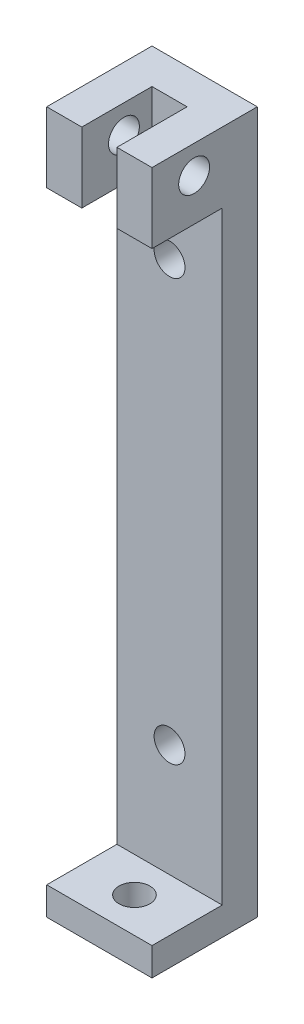
ISO-10303-21;
HEADER;
FILE_DESCRIPTION(('STEP AP214'),'2;1');
FILE_NAME('part.step','',(''),(''),'','','');
FILE_SCHEMA(('AUTOMOTIVE_DESIGN { 1 0 10303 214 1 1 1 1 }'));
ENDSEC;
DATA;
#1=APPLICATION_CONTEXT('core data for automotive mechanical design processes');
#2=APPLICATION_PROTOCOL_DEFINITION('international standard','automotive_design',2000,#1);
#3=PRODUCT_CONTEXT('',#1,'mechanical');
#4=PRODUCT('Part','Part','',(#3));
#5=PRODUCT_RELATED_PRODUCT_CATEGORY('part','',(#4));
#6=PRODUCT_DEFINITION_FORMATION('','',#4);
#7=PRODUCT_DEFINITION_CONTEXT('part definition',#1,'design');
#8=PRODUCT_DEFINITION('design','',#6,#7);
#9=PRODUCT_DEFINITION_SHAPE('','',#8);
#10=(LENGTH_UNIT() NAMED_UNIT(*) SI_UNIT(.MILLI.,.METRE.));
#11=(NAMED_UNIT(*) PLANE_ANGLE_UNIT() SI_UNIT($,.RADIAN.));
#12=(NAMED_UNIT(*) SI_UNIT($,.STERADIAN.) SOLID_ANGLE_UNIT());
#13=UNCERTAINTY_MEASURE_WITH_UNIT(LENGTH_MEASURE(1.E-05),#10,'distance_accuracy_value','');
#14=(GEOMETRIC_REPRESENTATION_CONTEXT(3) GLOBAL_UNCERTAINTY_ASSIGNED_CONTEXT((#13)) GLOBAL_UNIT_ASSIGNED_CONTEXT((#10,
#11,#12)) REPRESENTATION_CONTEXT('',''));
#15=CARTESIAN_POINT('',(0.,0.,0.));
#16=DIRECTION('',(0.,0.,1.));
#17=DIRECTION('',(1.,0.,0.));
#18=AXIS2_PLACEMENT_3D('',#15,#16,#17);
#19=CARTESIAN_POINT('',(-7.5,100.,-2.5));
#20=DIRECTION('',(0.,0.,-1.));
#21=DIRECTION('',(-1.,0.,0.));
#22=AXIS2_PLACEMENT_3D('',#19,#20,#21);
#23=PLANE('',#22);
#24=CARTESIAN_POINT('',(0.,20.,-2.5));
#25=DIRECTION('',(0.,0.,1.));
#26=DIRECTION('',(1.,0.,0.));
#27=AXIS2_PLACEMENT_3D('',#24,#25,#26);
#28=CIRCLE('',#27,2.2);
#29=CARTESIAN_POINT('',(2.2,20.,-2.5));
#30=VERTEX_POINT('',#29);
#31=EDGE_CURVE('E355',#30,#30,#28,.T.);
#32=ORIENTED_EDGE('',*,*,#31,.F.);
#33=EDGE_LOOP('',(#32));
#34=FACE_BOUND('',#33,.T.);
#35=CARTESIAN_POINT('',(0.,80.,-2.5));
#36=DIRECTION('',(0.,0.,1.));
#37=DIRECTION('',(1.,0.,0.));
#38=AXIS2_PLACEMENT_3D('',#35,#36,#37);
#39=CIRCLE('',#38,2.2);
#40=CARTESIAN_POINT('',(2.2,80.,-2.5));
#41=VERTEX_POINT('',#40);
#42=EDGE_CURVE('E358',#41,#41,#39,.T.);
#43=ORIENTED_EDGE('',*,*,#42,.F.);
#44=EDGE_LOOP('',(#43));
#45=FACE_BOUND('',#44,.T.);
#46=DIRECTION('',(0.,-1.,0.));
#47=VECTOR('',#46,1.);
#48=CARTESIAN_POINT('',(2.5,100.,-2.5));
#49=LINE('',#48,#47);
#50=CARTESIAN_POINT('',(2.5,100.,-2.5));
#51=VERTEX_POINT('',#50);
#52=CARTESIAN_POINT('',(2.5,90.,-2.5));
#53=VERTEX_POINT('',#52);
#54=EDGE_CURVE('E153',#51,#53,#49,.T.);
#55=ORIENTED_EDGE('',*,*,#54,.F.);
#56=DIRECTION('',(1.,0.,0.));
#57=VECTOR('',#56,1.);
#58=CARTESIAN_POINT('',(-7.5,100.,-2.5));
#59=LINE('',#58,#57);
#60=CARTESIAN_POINT('',(-2.5,100.,-2.5));
#61=VERTEX_POINT('',#60);
#62=EDGE_CURVE('E137',#61,#51,#59,.T.);
#63=ORIENTED_EDGE('',*,*,#62,.F.);
#64=DIRECTION('',(0.,1.,0.));
#65=VECTOR('',#64,1.);
#66=CARTESIAN_POINT('',(-2.5,100.,-2.5));
#67=LINE('',#66,#65);
#68=CARTESIAN_POINT('',(-2.5,90.,-2.5));
#69=VERTEX_POINT('',#68);
#70=EDGE_CURVE('E174',#69,#61,#67,.T.);
#71=ORIENTED_EDGE('',*,*,#70,.F.);
#72=DIRECTION('',(1.,0.,0.));
#73=VECTOR('',#72,1.);
#74=CARTESIAN_POINT('',(-7.5,90.,-2.5));
#75=LINE('',#74,#73);
#76=CARTESIAN_POINT('',(-7.5,90.,-2.5));
#77=VERTEX_POINT('',#76);
#78=EDGE_CURVE('E169',#77,#69,#75,.T.);
#79=ORIENTED_EDGE('',*,*,#78,.F.);
#80=DIRECTION('',(0.,-1.,0.));
#81=VECTOR('',#80,1.);
#82=CARTESIAN_POINT('',(-7.5,100.,-2.5));
#83=LINE('',#82,#81);
#84=CARTESIAN_POINT('',(-7.5,4.,-2.5));
#85=VERTEX_POINT('',#84);
#86=EDGE_CURVE('E58',#77,#85,#83,.T.);
#87=ORIENTED_EDGE('',*,*,#86,.T.);
#88=DIRECTION('',(1.,0.,0.));
#89=VECTOR('',#88,1.);
#90=CARTESIAN_POINT('',(-7.5,4.,-2.5));
#91=LINE('',#90,#89);
#92=CARTESIAN_POINT('',(7.5,4.,-2.5));
#93=VERTEX_POINT('',#92);
#94=EDGE_CURVE('E189',#85,#93,#91,.T.);
#95=ORIENTED_EDGE('',*,*,#94,.T.);
#96=DIRECTION('',(0.,-1.,0.));
#97=VECTOR('',#96,1.);
#98=CARTESIAN_POINT('',(7.5,100.,-2.5));
#99=LINE('',#98,#97);
#100=CARTESIAN_POINT('',(7.5,90.,-2.5));
#101=VERTEX_POINT('',#100);
#102=EDGE_CURVE('E196',#101,#93,#99,.T.);
#103=ORIENTED_EDGE('',*,*,#102,.F.);
#104=DIRECTION('',(1.,0.,0.));
#105=VECTOR('',#104,1.);
#106=CARTESIAN_POINT('',(7.5,90.,-2.5));
#107=LINE('',#106,#105);
#108=EDGE_CURVE('E151',#53,#101,#107,.T.);
#109=ORIENTED_EDGE('',*,*,#108,.F.);
#110=EDGE_LOOP('',(#55,#63,#71,#79,#87,#95,#103,#109));
#111=FACE_BOUND('',#110,.T.);
#112=ADVANCED_FACE('F35',(#34,#45,#111),#23,.F.);
#113=CARTESIAN_POINT('',(0.,4.,0.));
#114=DIRECTION('',(0.,-1.,0.));
#115=DIRECTION('',(0.,0.,-1.));
#116=AXIS2_PLACEMENT_3D('',#113,#114,#115);
#117=PLANE('',#116);
#118=CARTESIAN_POINT('',(0.,4.,2.5));
#119=DIRECTION('',(0.,1.,0.));
#120=DIRECTION('',(0.,0.,1.));
#121=AXIS2_PLACEMENT_3D('',#118,#119,#120);
#122=CIRCLE('',#121,2.2);
#123=CARTESIAN_POINT('',(0.,4.,4.7));
#124=VERTEX_POINT('',#123);
#125=EDGE_CURVE('E156',#124,#124,#122,.T.);
#126=ORIENTED_EDGE('',*,*,#125,.F.);
#127=EDGE_LOOP('',(#126));
#128=FACE_BOUND('',#127,.T.);
#129=ORIENTED_EDGE('',*,*,#94,.F.);
#130=DIRECTION('',(0.,0.,1.));
#131=VECTOR('',#130,1.);
#132=CARTESIAN_POINT('',(-7.5,4.,7.5));
#133=LINE('',#132,#131);
#134=CARTESIAN_POINT('',(-7.5,4.,7.5));
#135=VERTEX_POINT('',#134);
#136=EDGE_CURVE('E202',#85,#135,#133,.T.);
#137=ORIENTED_EDGE('',*,*,#136,.T.);
#138=DIRECTION('',(1.,0.,0.));
#139=VECTOR('',#138,1.);
#140=CARTESIAN_POINT('',(-7.5,4.,7.5));
#141=LINE('',#140,#139);
#142=CARTESIAN_POINT('',(7.5,4.,7.5));
#143=VERTEX_POINT('',#142);
#144=EDGE_CURVE('E205',#135,#143,#141,.T.);
#145=ORIENTED_EDGE('',*,*,#144,.T.);
#146=DIRECTION('',(0.,0.,-1.));
#147=VECTOR('',#146,1.);
#148=CARTESIAN_POINT('',(7.5,4.,7.5));
#149=LINE('',#148,#147);
#150=EDGE_CURVE('E199',#143,#93,#149,.T.);
#151=ORIENTED_EDGE('',*,*,#150,.T.);
#152=EDGE_LOOP('',(#129,#137,#145,#151));
#153=FACE_BOUND('',#152,.T.);
#154=ADVANCED_FACE('F237',(#128,#153),#117,.F.);
#155=CARTESIAN_POINT('',(7.5,4.,7.5));
#156=DIRECTION('',(-1.,0.,0.));
#157=DIRECTION('',(0.,0.,1.));
#158=AXIS2_PLACEMENT_3D('',#155,#156,#157);
#159=PLANE('',#158);
#160=CARTESIAN_POINT('',(7.5,96.,1.5));
#161=DIRECTION('',(1.,0.,0.));
#162=DIRECTION('',(0.,0.,-1.));
#163=AXIS2_PLACEMENT_3D('',#160,#161,#162);
#164=CIRCLE('',#163,2.19999999999999);
#165=CARTESIAN_POINT('',(7.5,96.,-0.699999999999994));
#166=VERTEX_POINT('',#165);
#167=EDGE_CURVE('E315',#166,#166,#164,.T.);
#168=ORIENTED_EDGE('',*,*,#167,.F.);
#169=EDGE_LOOP('',(#168));
#170=FACE_BOUND('',#169,.T.);
#171=DIRECTION('',(0.,0.,-1.));
#172=VECTOR('',#171,1.);
#173=CARTESIAN_POINT('',(7.5,0.,7.5));
#174=LINE('',#173,#172);
#175=CARTESIAN_POINT('',(7.5,0.,7.5));
#176=VERTEX_POINT('',#175);
#177=CARTESIAN_POINT('',(7.5,0.,-7.5));
#178=VERTEX_POINT('',#177);
#179=EDGE_CURVE('E198',#176,#178,#174,.T.);
#180=ORIENTED_EDGE('',*,*,#179,.T.);
#181=DIRECTION('',(0.,-1.,0.));
#182=VECTOR('',#181,1.);
#183=CARTESIAN_POINT('',(7.5,4.,-7.5));
#184=LINE('',#183,#182);
#185=CARTESIAN_POINT('',(7.5,100.,-7.5));
#186=VERTEX_POINT('',#185);
#187=EDGE_CURVE('E11',#186,#178,#184,.T.);
#188=ORIENTED_EDGE('',*,*,#187,.F.);
#189=DIRECTION('',(0.,0.,1.));
#190=VECTOR('',#189,1.);
#191=CARTESIAN_POINT('',(7.5,100.,-7.5));
#192=LINE('',#191,#190);
#193=CARTESIAN_POINT('',(7.5,100.,7.5));
#194=VERTEX_POINT('',#193);
#195=EDGE_CURVE('E128',#186,#194,#192,.T.);
#196=ORIENTED_EDGE('',*,*,#195,.T.);
#197=DIRECTION('',(0.,1.,0.));
#198=VECTOR('',#197,1.);
#199=CARTESIAN_POINT('',(7.5,100.,7.5));
#200=LINE('',#199,#198);
#201=CARTESIAN_POINT('',(7.5,90.,7.5));
#202=VERTEX_POINT('',#201);
#203=EDGE_CURVE('E133',#202,#194,#200,.T.);
#204=ORIENTED_EDGE('',*,*,#203,.F.);
#205=DIRECTION('',(0.,0.,-1.));
#206=VECTOR('',#205,1.);
#207=CARTESIAN_POINT('',(7.5,90.,7.5));
#208=LINE('',#207,#206);
#209=EDGE_CURVE('E161',#202,#101,#208,.T.);
#210=ORIENTED_EDGE('',*,*,#209,.T.);
#211=ORIENTED_EDGE('',*,*,#102,.T.);
#212=ORIENTED_EDGE('',*,*,#150,.F.);
#213=DIRECTION('',(0.,-1.,0.));
#214=VECTOR('',#213,1.);
#215=CARTESIAN_POINT('',(7.5,4.,7.5));
#216=LINE('',#215,#214);
#217=EDGE_CURVE('E207',#143,#176,#216,.T.);
#218=ORIENTED_EDGE('',*,*,#217,.T.);
#219=EDGE_LOOP('',(#180,#188,#196,#204,#210,#211,#212,#218));
#220=FACE_BOUND('',#219,.T.);
#221=ADVANCED_FACE('F37',(#170,#220),#159,.F.);
#222=CARTESIAN_POINT('',(-7.5,4.,-7.5));
#223=DIRECTION('',(0.,0.,1.));
#224=DIRECTION('',(1.,0.,0.));
#225=AXIS2_PLACEMENT_3D('',#222,#223,#224);
#226=PLANE('',#225);
#227=CARTESIAN_POINT('',(0.,20.,-7.5));
#228=DIRECTION('',(0.,0.,1.));
#229=DIRECTION('',(1.,0.,0.));
#230=AXIS2_PLACEMENT_3D('',#227,#228,#229);
#231=CIRCLE('',#230,2.2);
#232=CARTESIAN_POINT('',(2.2,20.,-7.5));
#233=VERTEX_POINT('',#232);
#234=EDGE_CURVE('E290',#233,#233,#231,.T.);
#235=ORIENTED_EDGE('',*,*,#234,.T.);
#236=EDGE_LOOP('',(#235));
#237=FACE_BOUND('',#236,.T.);
#238=CARTESIAN_POINT('',(0.,80.,-7.5));
#239=DIRECTION('',(0.,0.,1.));
#240=DIRECTION('',(1.,0.,0.));
#241=AXIS2_PLACEMENT_3D('',#238,#239,#240);
#242=CIRCLE('',#241,2.2);
#243=CARTESIAN_POINT('',(2.2,80.,-7.5));
#244=VERTEX_POINT('',#243);
#245=EDGE_CURVE('E293',#244,#244,#242,.T.);
#246=ORIENTED_EDGE('',*,*,#245,.T.);
#247=EDGE_LOOP('',(#246));
#248=FACE_BOUND('',#247,.T.);
#249=DIRECTION('',(-1.,0.,0.));
#250=VECTOR('',#249,1.);
#251=CARTESIAN_POINT('',(-7.5,0.,-7.5));
#252=LINE('',#251,#250);
#253=CARTESIAN_POINT('',(-7.5,0.,-7.5));
#254=VERTEX_POINT('',#253);
#255=EDGE_CURVE('E209',#178,#254,#252,.T.);
#256=ORIENTED_EDGE('',*,*,#255,.T.);
#257=DIRECTION('',(0.,-1.,0.));
#258=VECTOR('',#257,1.);
#259=CARTESIAN_POINT('',(-7.5,4.,-7.5));
#260=LINE('',#259,#258);
#261=CARTESIAN_POINT('',(-7.5,100.,-7.5));
#262=VERTEX_POINT('',#261);
#263=EDGE_CURVE('E43',#262,#254,#260,.T.);
#264=ORIENTED_EDGE('',*,*,#263,.F.);
#265=DIRECTION('',(1.,0.,0.));
#266=VECTOR('',#265,1.);
#267=CARTESIAN_POINT('',(-7.5,100.,-7.5));
#268=LINE('',#267,#266);
#269=EDGE_CURVE('E136',#262,#186,#268,.T.);
#270=ORIENTED_EDGE('',*,*,#269,.T.);
#271=ORIENTED_EDGE('',*,*,#187,.T.);
#272=EDGE_LOOP('',(#256,#264,#270,#271));
#273=FACE_BOUND('',#272,.T.);
#274=ADVANCED_FACE('F279',(#237,#248,#273),#226,.F.);
#275=CARTESIAN_POINT('',(-7.5,4.,7.5));
#276=DIRECTION('',(1.,0.,0.));
#277=DIRECTION('',(0.,0.,-1.));
#278=AXIS2_PLACEMENT_3D('',#275,#276,#277);
#279=PLANE('',#278);
#280=CARTESIAN_POINT('',(-7.5,96.,1.5));
#281=DIRECTION('',(-1.,0.,0.));
#282=DIRECTION('',(0.,0.,1.));
#283=AXIS2_PLACEMENT_3D('',#280,#281,#282);
#284=CIRCLE('',#283,2.19999999999999);
#285=CARTESIAN_POINT('',(-7.5,96.,3.69999999999999));
#286=VERTEX_POINT('',#285);
#287=EDGE_CURVE('E312',#286,#286,#284,.T.);
#288=ORIENTED_EDGE('',*,*,#287,.F.);
#289=EDGE_LOOP('',(#288));
#290=FACE_BOUND('',#289,.T.);
#291=DIRECTION('',(0.,0.,1.));
#292=VECTOR('',#291,1.);
#293=CARTESIAN_POINT('',(-7.5,0.,7.5));
#294=LINE('',#293,#292);
#295=CARTESIAN_POINT('',(-7.5,0.,7.5));
#296=VERTEX_POINT('',#295);
#297=EDGE_CURVE('E211',#254,#296,#294,.T.);
#298=ORIENTED_EDGE('',*,*,#297,.T.);
#299=DIRECTION('',(0.,-1.,0.));
#300=VECTOR('',#299,1.);
#301=CARTESIAN_POINT('',(-7.5,4.,7.5));
#302=LINE('',#301,#300);
#303=EDGE_CURVE('E216',#135,#296,#302,.T.);
#304=ORIENTED_EDGE('',*,*,#303,.F.);
#305=ORIENTED_EDGE('',*,*,#136,.F.);
#306=ORIENTED_EDGE('',*,*,#86,.F.);
#307=DIRECTION('',(0.,0.,-1.));
#308=VECTOR('',#307,1.);
#309=CARTESIAN_POINT('',(-7.5,90.,7.5));
#310=LINE('',#309,#308);
#311=CARTESIAN_POINT('',(-7.5,90.,7.5));
#312=VERTEX_POINT('',#311);
#313=EDGE_CURVE('E187',#312,#77,#310,.T.);
#314=ORIENTED_EDGE('',*,*,#313,.F.);
#315=DIRECTION('',(0.,-1.,0.));
#316=VECTOR('',#315,1.);
#317=CARTESIAN_POINT('',(-7.5,100.,7.5));
#318=LINE('',#317,#316);
#319=CARTESIAN_POINT('',(-7.5,100.,7.5));
#320=VERTEX_POINT('',#319);
#321=EDGE_CURVE('E170',#320,#312,#318,.T.);
#322=ORIENTED_EDGE('',*,*,#321,.F.);
#323=DIRECTION('',(0.,0.,1.));
#324=VECTOR('',#323,1.);
#325=CARTESIAN_POINT('',(-7.5,100.,-7.5));
#326=LINE('',#325,#324);
#327=EDGE_CURVE('E192',#262,#320,#326,.T.);
#328=ORIENTED_EDGE('',*,*,#327,.F.);
#329=ORIENTED_EDGE('',*,*,#263,.T.);
#330=EDGE_LOOP('',(#298,#304,#305,#306,#314,#322,#328,#329));
#331=FACE_BOUND('',#330,.T.);
#332=ADVANCED_FACE('F222',(#290,#331),#279,.F.);
#333=CARTESIAN_POINT('',(-7.5,4.,7.5));
#334=DIRECTION('',(0.,0.,-1.));
#335=DIRECTION('',(-1.,0.,0.));
#336=AXIS2_PLACEMENT_3D('',#333,#334,#335);
#337=PLANE('',#336);
#338=DIRECTION('',(1.,0.,0.));
#339=VECTOR('',#338,1.);
#340=CARTESIAN_POINT('',(-7.5,0.,7.5));
#341=LINE('',#340,#339);
#342=EDGE_CURVE('E203',#296,#176,#341,.T.);
#343=ORIENTED_EDGE('',*,*,#342,.T.);
#344=ORIENTED_EDGE('',*,*,#217,.F.);
#345=ORIENTED_EDGE('',*,*,#144,.F.);
#346=ORIENTED_EDGE('',*,*,#303,.T.);
#347=EDGE_LOOP('',(#343,#344,#345,#346));
#348=FACE_BOUND('',#347,.T.);
#349=ADVANCED_FACE('F232',(#348),#337,.F.);
#350=CARTESIAN_POINT('',(0.,0.,0.));
#351=DIRECTION('',(0.,-1.,0.));
#352=DIRECTION('',(0.,0.,-1.));
#353=AXIS2_PLACEMENT_3D('',#350,#351,#352);
#354=PLANE('',#353);
#355=CARTESIAN_POINT('',(0.,0.,2.5));
#356=DIRECTION('',(0.,1.,0.));
#357=DIRECTION('',(0.,0.,1.));
#358=AXIS2_PLACEMENT_3D('',#355,#356,#357);
#359=CIRCLE('',#358,2.2);
#360=CARTESIAN_POINT('',(0.,0.,4.7));
#361=VERTEX_POINT('',#360);
#362=EDGE_CURVE('E162',#361,#361,#359,.T.);
#363=ORIENTED_EDGE('',*,*,#362,.T.);
#364=EDGE_LOOP('',(#363));
#365=FACE_BOUND('',#364,.T.);
#366=ORIENTED_EDGE('',*,*,#179,.F.);
#367=ORIENTED_EDGE('',*,*,#342,.F.);
#368=ORIENTED_EDGE('',*,*,#297,.F.);
#369=ORIENTED_EDGE('',*,*,#255,.F.);
#370=EDGE_LOOP('',(#366,#367,#368,#369));
#371=FACE_BOUND('',#370,.T.);
#372=ADVANCED_FACE('F229',(#365,#371),#354,.T.);
#373=CARTESIAN_POINT('',(0.,100.,0.));
#374=DIRECTION('',(0.,-1.,0.));
#375=DIRECTION('',(0.,0.,-1.));
#376=AXIS2_PLACEMENT_3D('',#373,#374,#375);
#377=PLANE('',#376);
#378=ORIENTED_EDGE('',*,*,#327,.T.);
#379=DIRECTION('',(-1.,0.,0.));
#380=VECTOR('',#379,1.);
#381=CARTESIAN_POINT('',(-7.5,100.,7.5));
#382=LINE('',#381,#380);
#383=CARTESIAN_POINT('',(-2.5,100.,7.5));
#384=VERTEX_POINT('',#383);
#385=EDGE_CURVE('E178',#384,#320,#382,.T.);
#386=ORIENTED_EDGE('',*,*,#385,.F.);
#387=DIRECTION('',(0.,0.,-1.));
#388=VECTOR('',#387,1.);
#389=CARTESIAN_POINT('',(-2.5,100.,7.5));
#390=LINE('',#389,#388);
#391=EDGE_CURVE('E50',#384,#61,#390,.T.);
#392=ORIENTED_EDGE('',*,*,#391,.T.);
#393=ORIENTED_EDGE('',*,*,#62,.T.);
#394=DIRECTION('',(0.,0.,-1.));
#395=VECTOR('',#394,1.);
#396=CARTESIAN_POINT('',(2.5,100.,7.5));
#397=LINE('',#396,#395);
#398=CARTESIAN_POINT('',(2.5,100.,7.5));
#399=VERTEX_POINT('',#398);
#400=EDGE_CURVE('E142',#399,#51,#397,.T.);
#401=ORIENTED_EDGE('',*,*,#400,.F.);
#402=DIRECTION('',(-1.,0.,0.));
#403=VECTOR('',#402,1.);
#404=CARTESIAN_POINT('',(7.5,100.,7.5));
#405=LINE('',#404,#403);
#406=EDGE_CURVE('E140',#194,#399,#405,.T.);
#407=ORIENTED_EDGE('',*,*,#406,.F.);
#408=ORIENTED_EDGE('',*,*,#195,.F.);
#409=ORIENTED_EDGE('',*,*,#269,.F.);
#410=EDGE_LOOP('',(#378,#386,#392,#393,#401,#407,#408,#409));
#411=FACE_BOUND('',#410,.T.);
#412=ADVANCED_FACE('F141',(#411),#377,.F.);
#413=CARTESIAN_POINT('',(-7.5,90.,7.5));
#414=DIRECTION('',(0.,1.,0.));
#415=DIRECTION('',(0.,0.,1.));
#416=AXIS2_PLACEMENT_3D('',#413,#414,#415);
#417=PLANE('',#416);
#418=ORIENTED_EDGE('',*,*,#78,.T.);
#419=DIRECTION('',(0.,0.,-1.));
#420=VECTOR('',#419,1.);
#421=CARTESIAN_POINT('',(-2.5,90.,7.5));
#422=LINE('',#421,#420);
#423=CARTESIAN_POINT('',(-2.5,90.,7.5));
#424=VERTEX_POINT('',#423);
#425=EDGE_CURVE('E184',#424,#69,#422,.T.);
#426=ORIENTED_EDGE('',*,*,#425,.F.);
#427=DIRECTION('',(1.,0.,0.));
#428=VECTOR('',#427,1.);
#429=CARTESIAN_POINT('',(-7.5,90.,7.5));
#430=LINE('',#429,#428);
#431=EDGE_CURVE('E173',#312,#424,#430,.T.);
#432=ORIENTED_EDGE('',*,*,#431,.F.);
#433=ORIENTED_EDGE('',*,*,#313,.T.);
#434=EDGE_LOOP('',(#418,#426,#432,#433));
#435=FACE_BOUND('',#434,.T.);
#436=ADVANCED_FACE('F297',(#435),#417,.F.);
#437=CARTESIAN_POINT('',(-2.5,100.,7.5));
#438=DIRECTION('',(-1.,0.,0.));
#439=DIRECTION('',(0.,-1.,0.));
#440=AXIS2_PLACEMENT_3D('',#437,#438,#439);
#441=PLANE('',#440);
#442=CARTESIAN_POINT('',(-2.5,96.,1.5));
#443=DIRECTION('',(-1.,0.,0.));
#444=DIRECTION('',(0.,-1.,0.));
#445=AXIS2_PLACEMENT_3D('',#442,#443,#444);
#446=CIRCLE('',#445,2.19999999999999);
#447=CARTESIAN_POINT('',(-2.5,93.8,1.5));
#448=VERTEX_POINT('',#447);
#449=EDGE_CURVE('E309',#448,#448,#446,.T.);
#450=ORIENTED_EDGE('',*,*,#449,.T.);
#451=EDGE_LOOP('',(#450));
#452=FACE_BOUND('',#451,.T.);
#453=ORIENTED_EDGE('',*,*,#70,.T.);
#454=ORIENTED_EDGE('',*,*,#391,.F.);
#455=DIRECTION('',(0.,1.,0.));
#456=VECTOR('',#455,1.);
#457=CARTESIAN_POINT('',(-2.5,100.,7.5));
#458=LINE('',#457,#456);
#459=EDGE_CURVE('E176',#424,#384,#458,.T.);
#460=ORIENTED_EDGE('',*,*,#459,.F.);
#461=ORIENTED_EDGE('',*,*,#425,.T.);
#462=EDGE_LOOP('',(#453,#454,#460,#461));
#463=FACE_BOUND('',#462,.T.);
#464=ADVANCED_FACE('F256',(#452,#463),#441,.F.);
#465=CARTESIAN_POINT('',(0.,0.,7.5));
#466=DIRECTION('',(0.,0.,1.));
#467=DIRECTION('',(1.,0.,0.));
#468=AXIS2_PLACEMENT_3D('',#465,#466,#467);
#469=PLANE('',#468);
#470=ORIENTED_EDGE('',*,*,#321,.T.);
#471=ORIENTED_EDGE('',*,*,#431,.T.);
#472=ORIENTED_EDGE('',*,*,#459,.T.);
#473=ORIENTED_EDGE('',*,*,#385,.T.);
#474=EDGE_LOOP('',(#470,#471,#472,#473));
#475=FACE_BOUND('',#474,.T.);
#476=ADVANCED_FACE('F248',(#475),#469,.T.);
#477=CARTESIAN_POINT('',(2.5,100.,7.5));
#478=DIRECTION('',(1.,0.,0.));
#479=DIRECTION('',(0.,1.,0.));
#480=AXIS2_PLACEMENT_3D('',#477,#478,#479);
#481=PLANE('',#480);
#482=CARTESIAN_POINT('',(2.5,96.,1.5));
#483=DIRECTION('',(1.,0.,0.));
#484=DIRECTION('',(0.,1.,0.));
#485=AXIS2_PLACEMENT_3D('',#482,#483,#484);
#486=CIRCLE('',#485,2.19999999999999);
#487=CARTESIAN_POINT('',(2.5,98.2,1.5));
#488=VERTEX_POINT('',#487);
#489=EDGE_CURVE('E311',#488,#488,#486,.F.);
#490=ORIENTED_EDGE('',*,*,#489,.F.);
#491=EDGE_LOOP('',(#490));
#492=FACE_BOUND('',#491,.T.);
#493=ORIENTED_EDGE('',*,*,#54,.T.);
#494=DIRECTION('',(0.,0.,-1.));
#495=VECTOR('',#494,1.);
#496=CARTESIAN_POINT('',(2.5,90.,7.5));
#497=LINE('',#496,#495);
#498=CARTESIAN_POINT('',(2.5,90.,7.5));
#499=VERTEX_POINT('',#498);
#500=EDGE_CURVE('E165',#499,#53,#497,.T.);
#501=ORIENTED_EDGE('',*,*,#500,.F.);
#502=DIRECTION('',(0.,-1.,0.));
#503=VECTOR('',#502,1.);
#504=CARTESIAN_POINT('',(2.5,100.,7.5));
#505=LINE('',#504,#503);
#506=EDGE_CURVE('E145',#399,#499,#505,.T.);
#507=ORIENTED_EDGE('',*,*,#506,.F.);
#508=ORIENTED_EDGE('',*,*,#400,.T.);
#509=EDGE_LOOP('',(#493,#501,#507,#508));
#510=FACE_BOUND('',#509,.T.);
#511=ADVANCED_FACE('F246',(#492,#510),#481,.F.);
#512=CARTESIAN_POINT('',(7.5,90.,7.5));
#513=DIRECTION('',(0.,1.,0.));
#514=DIRECTION('',(0.,0.,1.));
#515=AXIS2_PLACEMENT_3D('',#512,#513,#514);
#516=PLANE('',#515);
#517=ORIENTED_EDGE('',*,*,#108,.T.);
#518=ORIENTED_EDGE('',*,*,#209,.F.);
#519=DIRECTION('',(1.,0.,0.));
#520=VECTOR('',#519,1.);
#521=CARTESIAN_POINT('',(7.5,90.,7.5));
#522=LINE('',#521,#520);
#523=EDGE_CURVE('E149',#499,#202,#522,.T.);
#524=ORIENTED_EDGE('',*,*,#523,.F.);
#525=ORIENTED_EDGE('',*,*,#500,.T.);
#526=EDGE_LOOP('',(#517,#518,#524,#525));
#527=FACE_BOUND('',#526,.T.);
#528=ADVANCED_FACE('F243',(#527),#516,.F.);
#529=CARTESIAN_POINT('',(0.,0.,7.5));
#530=DIRECTION('',(0.,0.,-1.));
#531=DIRECTION('',(-1.,0.,0.));
#532=AXIS2_PLACEMENT_3D('',#529,#530,#531);
#533=PLANE('',#532);
#534=ORIENTED_EDGE('',*,*,#203,.T.);
#535=ORIENTED_EDGE('',*,*,#406,.T.);
#536=ORIENTED_EDGE('',*,*,#506,.T.);
#537=ORIENTED_EDGE('',*,*,#523,.T.);
#538=EDGE_LOOP('',(#534,#535,#536,#537));
#539=FACE_BOUND('',#538,.T.);
#540=ADVANCED_FACE('F147',(#539),#533,.F.);
#541=CARTESIAN_POINT('',(0.,0.,2.5));
#542=DIRECTION('',(0.,1.,0.));
#543=DIRECTION('',(0.,0.,1.));
#544=AXIS2_PLACEMENT_3D('',#541,#542,#543);
#545=CYLINDRICAL_SURFACE('',#544,2.2);
#546=ORIENTED_EDGE('',*,*,#362,.F.);
#547=EDGE_LOOP('',(#546));
#548=FACE_BOUND('',#547,.T.);
#549=ORIENTED_EDGE('',*,*,#125,.T.);
#550=EDGE_LOOP('',(#549));
#551=FACE_BOUND('',#550,.T.);
#552=ADVANCED_FACE('F327',(#548,#551),#545,.F.);
#553=CARTESIAN_POINT('',(-7.501,96.,1.5));
#554=DIRECTION('',(1.,0.,0.));
#555=DIRECTION('',(0.,0.,-1.));
#556=AXIS2_PLACEMENT_3D('',#553,#554,#555);
#557=CYLINDRICAL_SURFACE('',#556,2.19999999999999);
#558=ORIENTED_EDGE('',*,*,#167,.T.);
#559=EDGE_LOOP('',(#558));
#560=FACE_BOUND('',#559,.T.);
#561=ORIENTED_EDGE('',*,*,#489,.T.);
#562=EDGE_LOOP('',(#561));
#563=FACE_BOUND('',#562,.T.);
#564=ADVANCED_FACE('F329',(#560,#563),#557,.F.);
#565=CARTESIAN_POINT('',(7.5,96.,1.5));
#566=DIRECTION('',(-1.,0.,0.));
#567=DIRECTION('',(0.,0.,1.));
#568=AXIS2_PLACEMENT_3D('',#565,#566,#567);
#569=CYLINDRICAL_SURFACE('',#568,2.19999999999999);
#570=ORIENTED_EDGE('',*,*,#287,.T.);
#571=EDGE_LOOP('',(#570));
#572=FACE_BOUND('',#571,.T.);
#573=ORIENTED_EDGE('',*,*,#449,.F.);
#574=EDGE_LOOP('',(#573));
#575=FACE_BOUND('',#574,.T.);
#576=ADVANCED_FACE('F336',(#572,#575),#569,.F.);
#577=CARTESIAN_POINT('',(0.,80.,-7.5));
#578=DIRECTION('',(0.,0.,1.));
#579=DIRECTION('',(1.,0.,0.));
#580=AXIS2_PLACEMENT_3D('',#577,#578,#579);
#581=CYLINDRICAL_SURFACE('',#580,2.2);
#582=ORIENTED_EDGE('',*,*,#245,.F.);
#583=EDGE_LOOP('',(#582));
#584=FACE_BOUND('',#583,.T.);
#585=ORIENTED_EDGE('',*,*,#42,.T.);
#586=EDGE_LOOP('',(#585));
#587=FACE_BOUND('',#586,.T.);
#588=ADVANCED_FACE('F343',(#584,#587),#581,.F.);
#589=CARTESIAN_POINT('',(0.,20.,-7.5));
#590=DIRECTION('',(0.,0.,1.));
#591=DIRECTION('',(1.,0.,0.));
#592=AXIS2_PLACEMENT_3D('',#589,#590,#591);
#593=CYLINDRICAL_SURFACE('',#592,2.2);
#594=ORIENTED_EDGE('',*,*,#234,.F.);
#595=EDGE_LOOP('',(#594));
#596=FACE_BOUND('',#595,.T.);
#597=ORIENTED_EDGE('',*,*,#31,.T.);
#598=EDGE_LOOP('',(#597));
#599=FACE_BOUND('',#598,.T.);
#600=ADVANCED_FACE('F347',(#596,#599),#593,.F.);
#601=CLOSED_SHELL('',(#112,#154,#221,#274,#332,#349,#372,#412,#436,#464,#476,#511,#528,#540,
#552,#564,#576,#588,#600));
#602=MANIFOLD_SOLID_BREP('B2',#601);
#603=ADVANCED_BREP_SHAPE_REPRESENTATION('',(#18,#602),#14);
#604=SHAPE_DEFINITION_REPRESENTATION(#9,#603);
ENDSEC;
END-ISO-10303-21;
